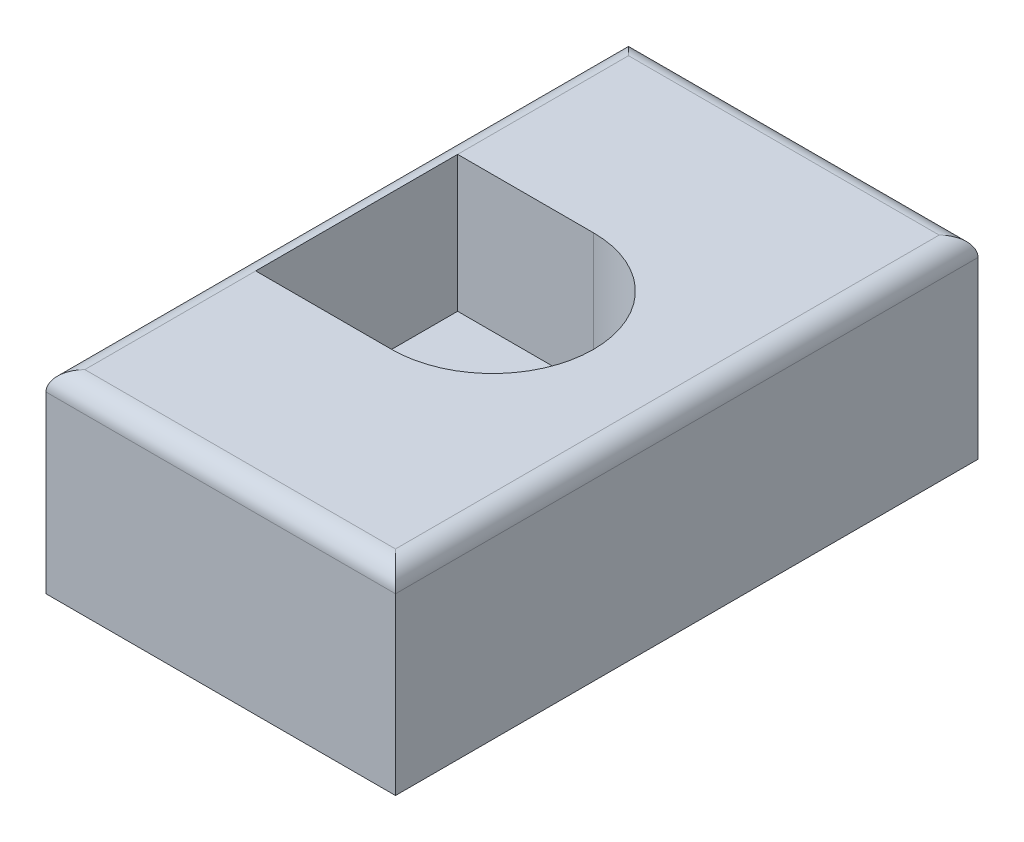
ISO-10303-21;
HEADER;
FILE_DESCRIPTION(('STEP AP214'),'2;1');
FILE_NAME('part.step','',(''),(''),'','','');
FILE_SCHEMA(('AUTOMOTIVE_DESIGN { 1 0 10303 214 1 1 1 1 }'));
ENDSEC;
DATA;
#1=APPLICATION_CONTEXT('core data for automotive mechanical design processes');
#2=APPLICATION_PROTOCOL_DEFINITION('international standard','automotive_design',2000,#1);
#3=PRODUCT_CONTEXT('',#1,'mechanical');
#4=PRODUCT('Part','Part','',(#3));
#5=PRODUCT_RELATED_PRODUCT_CATEGORY('part','',(#4));
#6=PRODUCT_DEFINITION_FORMATION('','',#4);
#7=PRODUCT_DEFINITION_CONTEXT('part definition',#1,'design');
#8=PRODUCT_DEFINITION('design','',#6,#7);
#9=PRODUCT_DEFINITION_SHAPE('','',#8);
#10=(LENGTH_UNIT() NAMED_UNIT(*) SI_UNIT(.MILLI.,.METRE.));
#11=(NAMED_UNIT(*) PLANE_ANGLE_UNIT() SI_UNIT($,.RADIAN.));
#12=(NAMED_UNIT(*) SI_UNIT($,.STERADIAN.) SOLID_ANGLE_UNIT());
#13=UNCERTAINTY_MEASURE_WITH_UNIT(LENGTH_MEASURE(1.E-05),#10,'distance_accuracy_value','');
#14=(GEOMETRIC_REPRESENTATION_CONTEXT(3) GLOBAL_UNCERTAINTY_ASSIGNED_CONTEXT((#13)) GLOBAL_UNIT_ASSIGNED_CONTEXT((#10,
#11,#12)) REPRESENTATION_CONTEXT('',''));
#15=CARTESIAN_POINT('',(0.,0.,0.));
#16=DIRECTION('',(0.,0.,1.));
#17=DIRECTION('',(1.,0.,0.));
#18=AXIS2_PLACEMENT_3D('',#15,#16,#17);
#19=CARTESIAN_POINT('',(9.99999999999999,25.,-298.863465253539));
#20=DIRECTION('',(-1.,0.,0.));
#21=DIRECTION('',(0.,0.,1.));
#22=AXIS2_PLACEMENT_3D('',#19,#20,#21);
#23=PLANE('',#22);
#24=DIRECTION('',(0.,-1.,0.));
#25=VECTOR('',#24,1.);
#26=CARTESIAN_POINT('',(9.99999999999999,25.,-328.863465253539));
#27=LINE('',#26,#25);
#28=CARTESIAN_POINT('',(9.99999999999999,24.,-328.863465253539));
#29=VERTEX_POINT('',#28);
#30=CARTESIAN_POINT('',(9.99999999999999,15.,-328.863465253539));
#31=VERTEX_POINT('',#30);
#32=EDGE_CURVE('E135',#29,#31,#27,.T.);
#33=ORIENTED_EDGE('',*,*,#32,.F.);
#34=DIRECTION('',(0.,0.,-1.));
#35=VECTOR('',#34,1.);
#36=CARTESIAN_POINT('',(9.99999999999999,24.,-298.863465253539));
#37=LINE('',#36,#35);
#38=CARTESIAN_POINT('',(9.99999999999999,24.,-298.863465253539));
#39=VERTEX_POINT('',#38);
#40=EDGE_CURVE('E153',#29,#39,#37,.F.);
#41=ORIENTED_EDGE('',*,*,#40,.T.);
#42=DIRECTION('',(0.,-1.,0.));
#43=VECTOR('',#42,1.);
#44=CARTESIAN_POINT('',(9.99999999999999,25.,-298.863465253539));
#45=LINE('',#44,#43);
#46=CARTESIAN_POINT('',(9.99999999999999,15.,-298.863465253539));
#47=VERTEX_POINT('',#46);
#48=EDGE_CURVE('E132',#39,#47,#45,.T.);
#49=ORIENTED_EDGE('',*,*,#48,.T.);
#50=DIRECTION('',(0.,0.,-1.));
#51=VECTOR('',#50,1.);
#52=CARTESIAN_POINT('',(9.99999999999999,15.,-298.863465253539));
#53=LINE('',#52,#51);
#54=EDGE_CURVE('E131',#47,#31,#53,.T.);
#55=ORIENTED_EDGE('',*,*,#54,.T.);
#56=EDGE_LOOP('',(#33,#41,#49,#55));
#57=FACE_BOUND('',#56,.T.);
#58=ADVANCED_FACE('F32',(#57),#23,.F.);
#59=CARTESIAN_POINT('',(-10.,25.,-328.863465253539));
#60=DIRECTION('',(0.,0.,1.));
#61=DIRECTION('',(1.,0.,0.));
#62=AXIS2_PLACEMENT_3D('',#59,#60,#61);
#63=PLANE('',#62);
#64=DIRECTION('',(0.,1.,0.));
#65=VECTOR('',#64,1.);
#66=CARTESIAN_POINT('',(-8.,25.,-328.863465253539));
#67=LINE('',#66,#65);
#68=CARTESIAN_POINT('',(-8.,15.,-328.863465253539));
#69=VERTEX_POINT('',#68);
#70=CARTESIAN_POINT('',(-8.,24.,-328.863465253539));
#71=VERTEX_POINT('',#70);
#72=EDGE_CURVE('E111',#69,#71,#67,.T.);
#73=ORIENTED_EDGE('',*,*,#72,.T.);
#74=DIRECTION('',(-1.,0.,0.));
#75=VECTOR('',#74,1.);
#76=CARTESIAN_POINT('',(-10.,24.,-328.863465253539));
#77=LINE('',#76,#75);
#78=EDGE_CURVE('E11',#71,#29,#77,.F.);
#79=ORIENTED_EDGE('',*,*,#78,.T.);
#80=ORIENTED_EDGE('',*,*,#32,.T.);
#81=DIRECTION('',(-1.,0.,0.));
#82=VECTOR('',#81,1.);
#83=CARTESIAN_POINT('',(-10.,15.,-328.863465253539));
#84=LINE('',#83,#82);
#85=EDGE_CURVE('E133',#31,#69,#84,.T.);
#86=ORIENTED_EDGE('',*,*,#85,.T.);
#87=EDGE_LOOP('',(#73,#79,#80,#86));
#88=FACE_BOUND('',#87,.T.);
#89=ADVANCED_FACE('F236',(#88),#63,.F.);
#90=CARTESIAN_POINT('',(-10.,25.,-298.863465253539));
#91=DIRECTION('',(0.,0.,-1.));
#92=DIRECTION('',(-1.,0.,0.));
#93=AXIS2_PLACEMENT_3D('',#90,#91,#92);
#94=PLANE('',#93);
#95=ORIENTED_EDGE('',*,*,#48,.F.);
#96=DIRECTION('',(1.,0.,0.));
#97=VECTOR('',#96,1.);
#98=CARTESIAN_POINT('',(-10.,24.,-298.863465253539));
#99=LINE('',#98,#97);
#100=CARTESIAN_POINT('',(-8.,24.,-298.863465253539));
#101=VERTEX_POINT('',#100);
#102=EDGE_CURVE('E126',#39,#101,#99,.F.);
#103=ORIENTED_EDGE('',*,*,#102,.T.);
#104=DIRECTION('',(0.,1.,0.));
#105=VECTOR('',#104,1.);
#106=CARTESIAN_POINT('',(-8.,25.,-298.863465253539));
#107=LINE('',#106,#105);
#108=CARTESIAN_POINT('',(-8.,15.,-298.863465253539));
#109=VERTEX_POINT('',#108);
#110=EDGE_CURVE('E110',#109,#101,#107,.T.);
#111=ORIENTED_EDGE('',*,*,#110,.F.);
#112=DIRECTION('',(1.,0.,0.));
#113=VECTOR('',#112,1.);
#114=CARTESIAN_POINT('',(-10.,15.,-298.863465253539));
#115=LINE('',#114,#113);
#116=EDGE_CURVE('E123',#109,#47,#115,.T.);
#117=ORIENTED_EDGE('',*,*,#116,.T.);
#118=EDGE_LOOP('',(#95,#103,#111,#117));
#119=FACE_BOUND('',#118,.T.);
#120=ADVANCED_FACE('F122',(#119),#94,.F.);
#121=CARTESIAN_POINT('',(0.,25.,0.));
#122=DIRECTION('',(0.,-1.,0.));
#123=DIRECTION('',(0.,0.,-1.));
#124=AXIS2_PLACEMENT_3D('',#121,#122,#123);
#125=PLANE('',#124);
#126=DIRECTION('',(1.,0.,0.));
#127=VECTOR('',#126,1.);
#128=CARTESIAN_POINT('',(0.,25.,-308.663465253539));
#129=LINE('',#128,#127);
#130=CARTESIAN_POINT('',(-7.,25.,-308.663465253539));
#131=VERTEX_POINT('',#130);
#132=CARTESIAN_POINT('',(0.,25.,-308.663465253539));
#133=VERTEX_POINT('',#132);
#134=EDGE_CURVE('E188',#131,#133,#129,.T.);
#135=ORIENTED_EDGE('',*,*,#134,.F.);
#136=DIRECTION('',(0.,0.,1.));
#137=VECTOR('',#136,1.);
#138=CARTESIAN_POINT('',(-7.,25.,0.));
#139=LINE('',#138,#137);
#140=CARTESIAN_POINT('',(-7.,25.,-299.863465253539));
#141=VERTEX_POINT('',#140);
#142=EDGE_CURVE('E150',#131,#141,#139,.T.);
#143=ORIENTED_EDGE('',*,*,#142,.T.);
#144=DIRECTION('',(1.,0.,0.));
#145=VECTOR('',#144,1.);
#146=CARTESIAN_POINT('',(0.,25.,-299.863465253539));
#147=LINE('',#146,#145);
#148=CARTESIAN_POINT('',(8.99999999999999,25.,-299.863465253539));
#149=VERTEX_POINT('',#148);
#150=EDGE_CURVE('E147',#141,#149,#147,.T.);
#151=ORIENTED_EDGE('',*,*,#150,.T.);
#152=DIRECTION('',(0.,0.,-1.));
#153=VECTOR('',#152,1.);
#154=CARTESIAN_POINT('',(8.99999999999999,25.,0.));
#155=LINE('',#154,#153);
#156=CARTESIAN_POINT('',(8.99999999999999,25.,-327.863465253539));
#157=VERTEX_POINT('',#156);
#158=EDGE_CURVE('E145',#149,#157,#155,.T.);
#159=ORIENTED_EDGE('',*,*,#158,.T.);
#160=DIRECTION('',(-1.,0.,0.));
#161=VECTOR('',#160,1.);
#162=CARTESIAN_POINT('',(0.,25.,-327.863465253539));
#163=LINE('',#162,#161);
#164=CARTESIAN_POINT('',(-7.,25.,-327.863465253539));
#165=VERTEX_POINT('',#164);
#166=EDGE_CURVE('E141',#157,#165,#163,.T.);
#167=ORIENTED_EDGE('',*,*,#166,.T.);
#168=DIRECTION('',(0.,0.,1.));
#169=VECTOR('',#168,1.);
#170=CARTESIAN_POINT('',(-7.,25.,0.));
#171=LINE('',#170,#169);
#172=CARTESIAN_POINT('',(-7.,25.,-319.063465253539));
#173=VERTEX_POINT('',#172);
#174=EDGE_CURVE('E143',#165,#173,#171,.T.);
#175=ORIENTED_EDGE('',*,*,#174,.T.);
#176=DIRECTION('',(-1.,0.,0.));
#177=VECTOR('',#176,1.);
#178=CARTESIAN_POINT('',(0.,25.,-319.063465253539));
#179=LINE('',#178,#177);
#180=CARTESIAN_POINT('',(0.,25.,-319.063465253539));
#181=VERTEX_POINT('',#180);
#182=EDGE_CURVE('E197',#181,#173,#179,.T.);
#183=ORIENTED_EDGE('',*,*,#182,.F.);
#184=CARTESIAN_POINT('',(0.,25.,-313.863465253539));
#185=DIRECTION('',(0.,1.,0.));
#186=DIRECTION('',(0.,0.,1.));
#187=AXIS2_PLACEMENT_3D('',#184,#185,#186);
#188=CIRCLE('',#187,5.19999999999998);
#189=EDGE_CURVE('E190',#133,#181,#188,.T.);
#190=ORIENTED_EDGE('',*,*,#189,.F.);
#191=EDGE_LOOP('',(#135,#143,#151,#159,#167,#175,#183,#190));
#192=FACE_BOUND('',#191,.T.);
#193=ADVANCED_FACE('F185',(#192),#125,.F.);
#194=CARTESIAN_POINT('',(0.,15.,0.));
#195=DIRECTION('',(0.,-1.,0.));
#196=DIRECTION('',(0.,0.,-1.));
#197=AXIS2_PLACEMENT_3D('',#194,#195,#196);
#198=PLANE('',#197);
#199=DIRECTION('',(0.,0.,1.));
#200=VECTOR('',#199,1.);
#201=CARTESIAN_POINT('',(-8.,15.,-328.863465253539));
#202=LINE('',#201,#200);
#203=EDGE_CURVE('E107',#69,#109,#202,.T.);
#204=ORIENTED_EDGE('',*,*,#203,.F.);
#205=ORIENTED_EDGE('',*,*,#85,.F.);
#206=ORIENTED_EDGE('',*,*,#54,.F.);
#207=ORIENTED_EDGE('',*,*,#116,.F.);
#208=EDGE_LOOP('',(#204,#205,#206,#207));
#209=FACE_BOUND('',#208,.T.);
#210=CARTESIAN_POINT('',(0.,15.,-313.863465253539));
#211=DIRECTION('',(0.,-1.,0.));
#212=DIRECTION('',(0.,0.,-1.));
#213=AXIS2_PLACEMENT_3D('',#210,#211,#212);
#214=CIRCLE('',#213,2.65000000000001);
#215=CARTESIAN_POINT('',(0.,15.,-316.513465253539));
#216=VERTEX_POINT('',#215);
#217=EDGE_CURVE('E223',#216,#216,#214,.T.);
#218=ORIENTED_EDGE('',*,*,#217,.F.);
#219=EDGE_LOOP('',(#218));
#220=FACE_BOUND('',#219,.T.);
#221=ADVANCED_FACE('F128',(#209,#220),#198,.T.);
#222=CARTESIAN_POINT('',(0.,18.,-313.863465253539));
#223=DIRECTION('',(0.,1.,0.));
#224=DIRECTION('',(0.,0.,1.));
#225=AXIS2_PLACEMENT_3D('',#222,#223,#224);
#226=CYLINDRICAL_SURFACE('',#225,5.19999999999998);
#227=ORIENTED_EDGE('',*,*,#189,.T.);
#228=DIRECTION('',(0.,1.,0.));
#229=VECTOR('',#228,1.);
#230=CARTESIAN_POINT('',(0.,18.,-319.063465253539));
#231=LINE('',#230,#229);
#232=CARTESIAN_POINT('',(0.,18.,-319.063465253539));
#233=VERTEX_POINT('',#232);
#234=EDGE_CURVE('E208',#233,#181,#231,.T.);
#235=ORIENTED_EDGE('',*,*,#234,.F.);
#236=CARTESIAN_POINT('',(0.,18.,-313.863465253539));
#237=DIRECTION('',(0.,1.,0.));
#238=DIRECTION('',(0.,0.,1.));
#239=AXIS2_PLACEMENT_3D('',#236,#237,#238);
#240=CIRCLE('',#239,5.19999999999998);
#241=CARTESIAN_POINT('',(0.,18.,-308.663465253539));
#242=VERTEX_POINT('',#241);
#243=EDGE_CURVE('E192',#242,#233,#240,.T.);
#244=ORIENTED_EDGE('',*,*,#243,.F.);
#245=DIRECTION('',(0.,1.,0.));
#246=VECTOR('',#245,1.);
#247=CARTESIAN_POINT('',(0.,18.,-308.663465253539));
#248=LINE('',#247,#246);
#249=EDGE_CURVE('E201',#242,#133,#248,.T.);
#250=ORIENTED_EDGE('',*,*,#249,.T.);
#251=EDGE_LOOP('',(#227,#235,#244,#250));
#252=FACE_BOUND('',#251,.T.);
#253=ADVANCED_FACE('F271',(#252),#226,.F.);
#254=CARTESIAN_POINT('',(0.,18.,-308.663465253539));
#255=DIRECTION('',(0.,0.,1.));
#256=DIRECTION('',(1.,0.,0.));
#257=AXIS2_PLACEMENT_3D('',#254,#255,#256);
#258=PLANE('',#257);
#259=ORIENTED_EDGE('',*,*,#134,.T.);
#260=ORIENTED_EDGE('',*,*,#249,.F.);
#261=DIRECTION('',(1.,0.,0.));
#262=VECTOR('',#261,1.);
#263=CARTESIAN_POINT('',(0.,18.,-308.663465253539));
#264=LINE('',#263,#262);
#265=CARTESIAN_POINT('',(-7.,18.,-308.663465253539));
#266=VERTEX_POINT('',#265);
#267=EDGE_CURVE('E210',#266,#242,#264,.T.);
#268=ORIENTED_EDGE('',*,*,#267,.F.);
#269=DIRECTION('',(0.,1.,0.));
#270=VECTOR('',#269,1.);
#271=CARTESIAN_POINT('',(-7.,18.,-308.663465253539));
#272=LINE('',#271,#270);
#273=EDGE_CURVE('E203',#266,#131,#272,.T.);
#274=ORIENTED_EDGE('',*,*,#273,.T.);
#275=EDGE_LOOP('',(#259,#260,#268,#274));
#276=FACE_BOUND('',#275,.T.);
#277=ADVANCED_FACE('F268',(#276),#258,.F.);
#278=CARTESIAN_POINT('',(-7.,18.,-319.063465253539));
#279=DIRECTION('',(-1.,0.,0.));
#280=DIRECTION('',(0.,0.,1.));
#281=AXIS2_PLACEMENT_3D('',#278,#279,#280);
#282=PLANE('',#281);
#283=DIRECTION('',(0.,0.,1.));
#284=VECTOR('',#283,1.);
#285=CARTESIAN_POINT('',(-7.,25.,-319.063465253539));
#286=LINE('',#285,#284);
#287=EDGE_CURVE('E182',#173,#131,#286,.T.);
#288=ORIENTED_EDGE('',*,*,#287,.T.);
#289=ORIENTED_EDGE('',*,*,#273,.F.);
#290=DIRECTION('',(0.,0.,1.));
#291=VECTOR('',#290,1.);
#292=CARTESIAN_POINT('',(-7.,18.,-319.063465253539));
#293=LINE('',#292,#291);
#294=CARTESIAN_POINT('',(-7.,18.,-319.063465253539));
#295=VERTEX_POINT('',#294);
#296=EDGE_CURVE('E215',#295,#266,#293,.T.);
#297=ORIENTED_EDGE('',*,*,#296,.F.);
#298=DIRECTION('',(0.,1.,0.));
#299=VECTOR('',#298,1.);
#300=CARTESIAN_POINT('',(-7.,18.,-319.063465253539));
#301=LINE('',#300,#299);
#302=EDGE_CURVE('E205',#295,#173,#301,.T.);
#303=ORIENTED_EDGE('',*,*,#302,.T.);
#304=EDGE_LOOP('',(#288,#289,#297,#303));
#305=FACE_BOUND('',#304,.T.);
#306=ADVANCED_FACE('F227',(#305),#282,.F.);
#307=CARTESIAN_POINT('',(0.,18.,-319.063465253539));
#308=DIRECTION('',(0.,0.,-1.));
#309=DIRECTION('',(-1.,0.,0.));
#310=AXIS2_PLACEMENT_3D('',#307,#308,#309);
#311=PLANE('',#310);
#312=ORIENTED_EDGE('',*,*,#182,.T.);
#313=ORIENTED_EDGE('',*,*,#302,.F.);
#314=DIRECTION('',(-1.,0.,0.));
#315=VECTOR('',#314,1.);
#316=CARTESIAN_POINT('',(0.,18.,-319.063465253539));
#317=LINE('',#316,#315);
#318=EDGE_CURVE('E195',#233,#295,#317,.T.);
#319=ORIENTED_EDGE('',*,*,#318,.F.);
#320=ORIENTED_EDGE('',*,*,#234,.T.);
#321=EDGE_LOOP('',(#312,#313,#319,#320));
#322=FACE_BOUND('',#321,.T.);
#323=ADVANCED_FACE('F224',(#322),#311,.F.);
#324=CARTESIAN_POINT('',(0.,18.,-313.863465253539));
#325=DIRECTION('',(0.,1.,0.));
#326=DIRECTION('',(0.,0.,1.));
#327=AXIS2_PLACEMENT_3D('',#324,#325,#326);
#328=PLANE('',#327);
#329=CARTESIAN_POINT('',(0.,18.,-313.863465253539));
#330=DIRECTION('',(0.,1.,0.));
#331=DIRECTION('',(0.,0.,1.));
#332=AXIS2_PLACEMENT_3D('',#329,#330,#331);
#333=CIRCLE('',#332,2.65000000000001);
#334=CARTESIAN_POINT('',(0.,18.,-311.213465253539));
#335=VERTEX_POINT('',#334);
#336=EDGE_CURVE('E116',#335,#335,#333,.T.);
#337=ORIENTED_EDGE('',*,*,#336,.F.);
#338=EDGE_LOOP('',(#337));
#339=FACE_BOUND('',#338,.T.);
#340=ORIENTED_EDGE('',*,*,#243,.T.);
#341=ORIENTED_EDGE('',*,*,#318,.T.);
#342=ORIENTED_EDGE('',*,*,#296,.T.);
#343=ORIENTED_EDGE('',*,*,#267,.T.);
#344=EDGE_LOOP('',(#340,#341,#342,#343));
#345=FACE_BOUND('',#344,.T.);
#346=ADVANCED_FACE('F229',(#339,#345),#328,.T.);
#347=CARTESIAN_POINT('',(0.,1.,-313.863465253539));
#348=DIRECTION('',(0.,1.,0.));
#349=DIRECTION('',(0.,0.,1.));
#350=AXIS2_PLACEMENT_3D('',#347,#348,#349);
#351=CYLINDRICAL_SURFACE('',#350,2.65000000000001);
#352=ORIENTED_EDGE('',*,*,#217,.T.);
#353=EDGE_LOOP('',(#352));
#354=FACE_BOUND('',#353,.T.);
#355=ORIENTED_EDGE('',*,*,#336,.T.);
#356=EDGE_LOOP('',(#355));
#357=FACE_BOUND('',#356,.T.);
#358=ADVANCED_FACE('F257',(#354,#357),#351,.F.);
#359=CARTESIAN_POINT('',(-8.,25.,-328.863465253539));
#360=DIRECTION('',(1.,0.,0.));
#361=DIRECTION('',(0.,1.,0.));
#362=AXIS2_PLACEMENT_3D('',#359,#360,#361);
#363=PLANE('',#362);
#364=ORIENTED_EDGE('',*,*,#110,.T.);
#365=DIRECTION('',(0.,0.,1.));
#366=VECTOR('',#365,1.);
#367=CARTESIAN_POINT('',(-8.,24.,-328.863465253539));
#368=LINE('',#367,#366);
#369=EDGE_CURVE('E41',#101,#71,#368,.F.);
#370=ORIENTED_EDGE('',*,*,#369,.T.);
#371=ORIENTED_EDGE('',*,*,#72,.F.);
#372=ORIENTED_EDGE('',*,*,#203,.T.);
#373=EDGE_LOOP('',(#364,#370,#371,#372));
#374=FACE_BOUND('',#373,.T.);
#375=ADVANCED_FACE('F109',(#374),#363,.F.);
#376=CARTESIAN_POINT('',(0.,24.,-327.863465253539));
#377=DIRECTION('',(-1.,0.,0.));
#378=DIRECTION('',(0.,0.,1.));
#379=AXIS2_PLACEMENT_3D('',#376,#377,#378);
#380=CYLINDRICAL_SURFACE('',#379,1.);
#381=CARTESIAN_POINT('',(8.99999999999999,24.,-327.863465253539));
#382=DIRECTION('',(-0.707106781186547,0.,-0.707106781186547));
#383=DIRECTION('',(-0.707106781186547,0.,0.707106781186547));
#384=AXIS2_PLACEMENT_3D('',#381,#382,#383);
#385=ELLIPSE('',#384,1.41421356237309,1.);
#386=EDGE_CURVE('E159',#29,#157,#385,.F.);
#387=ORIENTED_EDGE('',*,*,#386,.F.);
#388=ORIENTED_EDGE('',*,*,#78,.F.);
#389=CARTESIAN_POINT('',(-7.,24.,-327.863465253539));
#390=DIRECTION('',(-0.707106781186547,0.,0.707106781186547));
#391=DIRECTION('',(-0.707106781186547,0.,-0.707106781186547));
#392=AXIS2_PLACEMENT_3D('',#389,#390,#391);
#393=ELLIPSE('',#392,1.41421356237309,1.);
#394=EDGE_CURVE('E36',#165,#71,#393,.T.);
#395=ORIENTED_EDGE('',*,*,#394,.F.);
#396=ORIENTED_EDGE('',*,*,#166,.F.);
#397=EDGE_LOOP('',(#387,#388,#395,#396));
#398=FACE_BOUND('',#397,.T.);
#399=ADVANCED_FACE('F34',(#398),#380,.T.);
#400=CARTESIAN_POINT('',(-7.,24.,0.));
#401=DIRECTION('',(0.,0.,1.));
#402=DIRECTION('',(1.,0.,0.));
#403=AXIS2_PLACEMENT_3D('',#400,#401,#402);
#404=CYLINDRICAL_SURFACE('',#403,1.);
#405=ORIENTED_EDGE('',*,*,#394,.T.);
#406=ORIENTED_EDGE('',*,*,#369,.F.);
#407=CARTESIAN_POINT('',(-7.,24.,-299.863465253539));
#408=DIRECTION('',(0.707106781186547,0.,0.707106781186547));
#409=DIRECTION('',(-0.707106781186547,0.,0.707106781186547));
#410=AXIS2_PLACEMENT_3D('',#407,#408,#409);
#411=ELLIPSE('',#410,1.41421356237309,1.);
#412=EDGE_CURVE('E158',#141,#101,#411,.T.);
#413=ORIENTED_EDGE('',*,*,#412,.F.);
#414=ORIENTED_EDGE('',*,*,#142,.F.);
#415=ORIENTED_EDGE('',*,*,#287,.F.);
#416=ORIENTED_EDGE('',*,*,#174,.F.);
#417=EDGE_LOOP('',(#405,#406,#413,#414,#415,#416));
#418=FACE_BOUND('',#417,.T.);
#419=ADVANCED_FACE('F169',(#418),#404,.T.);
#420=CARTESIAN_POINT('',(8.99999999999999,24.,0.));
#421=DIRECTION('',(0.,0.,-1.));
#422=DIRECTION('',(-1.,0.,0.));
#423=AXIS2_PLACEMENT_3D('',#420,#421,#422);
#424=CYLINDRICAL_SURFACE('',#423,1.);
#425=ORIENTED_EDGE('',*,*,#386,.T.);
#426=ORIENTED_EDGE('',*,*,#158,.F.);
#427=CARTESIAN_POINT('',(8.99999999999999,24.,-299.863465253539));
#428=DIRECTION('',(0.707106781186547,0.,-0.707106781186547));
#429=DIRECTION('',(-0.707106781186547,0.,-0.707106781186547));
#430=AXIS2_PLACEMENT_3D('',#427,#428,#429);
#431=ELLIPSE('',#430,1.41421356237309,1.);
#432=EDGE_CURVE('E156',#39,#149,#431,.F.);
#433=ORIENTED_EDGE('',*,*,#432,.F.);
#434=ORIENTED_EDGE('',*,*,#40,.F.);
#435=EDGE_LOOP('',(#425,#426,#433,#434));
#436=FACE_BOUND('',#435,.T.);
#437=ADVANCED_FACE('F175',(#436),#424,.T.);
#438=CARTESIAN_POINT('',(0.,24.,-299.863465253539));
#439=DIRECTION('',(1.,0.,0.));
#440=DIRECTION('',(0.,0.,-1.));
#441=AXIS2_PLACEMENT_3D('',#438,#439,#440);
#442=CYLINDRICAL_SURFACE('',#441,1.);
#443=ORIENTED_EDGE('',*,*,#412,.T.);
#444=ORIENTED_EDGE('',*,*,#102,.F.);
#445=ORIENTED_EDGE('',*,*,#432,.T.);
#446=ORIENTED_EDGE('',*,*,#150,.F.);
#447=EDGE_LOOP('',(#443,#444,#445,#446));
#448=FACE_BOUND('',#447,.T.);
#449=ADVANCED_FACE('F178',(#448),#442,.T.);
#450=CLOSED_SHELL('',(#58,#89,#120,#193,#221,#253,#277,#306,#323,#346,#358,#375,#399,#419,#437,#449));
#451=MANIFOLD_SOLID_BREP('B2',#450);
#452=ADVANCED_BREP_SHAPE_REPRESENTATION('',(#18,#451),#14);
#453=SHAPE_DEFINITION_REPRESENTATION(#9,#452);
ENDSEC;
END-ISO-10303-21;
